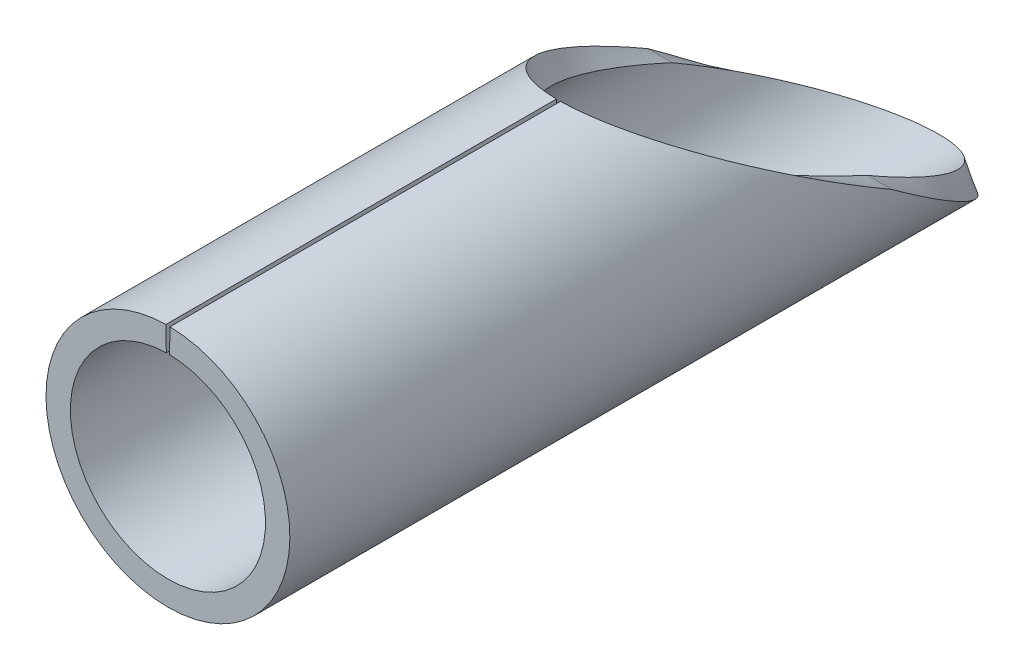
ISO-10303-21;
HEADER;
FILE_DESCRIPTION(('STEP AP214'),'2;1');
FILE_NAME('part.step','',(''),(''),'','','');
FILE_SCHEMA(('AUTOMOTIVE_DESIGN { 1 0 10303 214 1 1 1 1 }'));
ENDSEC;
DATA;
#1=APPLICATION_CONTEXT('core data for automotive mechanical design processes');
#2=APPLICATION_PROTOCOL_DEFINITION('international standard','automotive_design',2000,#1);
#3=PRODUCT_CONTEXT('',#1,'mechanical');
#4=PRODUCT('Part','Part','',(#3));
#5=PRODUCT_RELATED_PRODUCT_CATEGORY('part','',(#4));
#6=PRODUCT_DEFINITION_FORMATION('','',#4);
#7=PRODUCT_DEFINITION_CONTEXT('part definition',#1,'design');
#8=PRODUCT_DEFINITION('design','',#6,#7);
#9=PRODUCT_DEFINITION_SHAPE('','',#8);
#10=(LENGTH_UNIT() NAMED_UNIT(*) SI_UNIT(.MILLI.,.METRE.));
#11=(NAMED_UNIT(*) PLANE_ANGLE_UNIT() SI_UNIT($,.RADIAN.));
#12=(NAMED_UNIT(*) SI_UNIT($,.STERADIAN.) SOLID_ANGLE_UNIT());
#13=UNCERTAINTY_MEASURE_WITH_UNIT(LENGTH_MEASURE(1.E-05),#10,'distance_accuracy_value','');
#14=(GEOMETRIC_REPRESENTATION_CONTEXT(3) GLOBAL_UNCERTAINTY_ASSIGNED_CONTEXT((#13)) GLOBAL_UNIT_ASSIGNED_CONTEXT((#10,
#11,#12)) REPRESENTATION_CONTEXT('',''));
#15=CARTESIAN_POINT('',(0.,0.,0.));
#16=DIRECTION('',(0.,0.,1.));
#17=DIRECTION('',(1.,0.,0.));
#18=AXIS2_PLACEMENT_3D('',#15,#16,#17);
#19=CARTESIAN_POINT('',(0.,0.,100.));
#20=DIRECTION('',(0.,0.,-1.));
#21=DIRECTION('',(-1.,0.,0.));
#22=AXIS2_PLACEMENT_3D('',#19,#20,#21);
#23=CYLINDRICAL_SURFACE('',#22,15.);
#24=CARTESIAN_POINT('',(0.,0.,25.9807621135329));
#25=DIRECTION('',(0.,-0.866025403784436,0.500000000000004));
#26=DIRECTION('',(0.,-0.500000000000004,-0.866025403784436));
#27=AXIS2_PLACEMENT_3D('',#24,#25,#26);
#28=ELLIPSE('',#27,29.9999999999998,15.);
#29=CARTESIAN_POINT('',(-0.250000000000001,14.9979165219706,51.9579155372625));
#30=VERTEX_POINT('',#29);
#31=CARTESIAN_POINT('',(-15.,0.,25.9807621135329));
#32=VERTEX_POINT('',#31);
#33=EDGE_CURVE('E55',#30,#32,#28,.T.);
#34=ORIENTED_EDGE('',*,*,#33,.T.);
#35=CARTESIAN_POINT('',(0.,0.,25.9807621135329));
#36=DIRECTION('',(0.,-0.81088485407938,0.585205735980657));
#37=DIRECTION('',(0.,-0.585205735980657,-0.81088485407938));
#38=AXIS2_PLACEMENT_3D('',#35,#36,#37);
#39=ELLIPSE('',#38,25.6320112359524,15.);
#40=CARTESIAN_POINT('',(15.,0.,25.9807621135328));
#41=VERTEX_POINT('',#40);
#42=EDGE_CURVE('E109',#32,#41,#39,.T.);
#43=ORIENTED_EDGE('',*,*,#42,.T.);
#44=CARTESIAN_POINT('',(0.,0.,25.9807621135329));
#45=DIRECTION('',(0.,-0.866025403784436,0.500000000000004));
#46=DIRECTION('',(0.,-0.500000000000004,-0.866025403784436));
#47=AXIS2_PLACEMENT_3D('',#44,#45,#46);
#48=ELLIPSE('',#47,29.9999999999998,15.);
#49=CARTESIAN_POINT('',(0.250000000000002,14.9979165219706,51.9579155372625));
#50=VERTEX_POINT('',#49);
#51=EDGE_CURVE('E93',#41,#50,#48,.T.);
#52=ORIENTED_EDGE('',*,*,#51,.T.);
#53=DIRECTION('',(0.,0.,-1.));
#54=VECTOR('',#53,1.);
#55=CARTESIAN_POINT('',(0.250000000000002,14.9979165219706,100.));
#56=LINE('',#55,#54);
#57=CARTESIAN_POINT('',(0.250000000000002,14.9979165219706,100.));
#58=VERTEX_POINT('',#57);
#59=EDGE_CURVE('E11',#58,#50,#56,.T.);
#60=ORIENTED_EDGE('',*,*,#59,.F.);
#61=CARTESIAN_POINT('',(0.,0.,100.));
#62=DIRECTION('',(0.,0.,1.));
#63=DIRECTION('',(1.,0.,0.));
#64=AXIS2_PLACEMENT_3D('',#61,#62,#63);
#65=CIRCLE('',#64,15.);
#66=CARTESIAN_POINT('',(-0.250000000000001,14.9979165219706,100.));
#67=VERTEX_POINT('',#66);
#68=EDGE_CURVE('E126',#67,#58,#65,.T.);
#69=ORIENTED_EDGE('',*,*,#68,.F.);
#70=DIRECTION('',(0.,0.,-1.));
#71=VECTOR('',#70,1.);
#72=CARTESIAN_POINT('',(-0.250000000000001,14.9979165219706,100.));
#73=LINE('',#72,#71);
#74=EDGE_CURVE('E62',#67,#30,#73,.T.);
#75=ORIENTED_EDGE('',*,*,#74,.T.);
#76=EDGE_LOOP('',(#34,#43,#52,#60,#69,#75));
#77=FACE_BOUND('',#76,.T.);
#78=ADVANCED_FACE('F41',(#77),#23,.T.);
#79=CARTESIAN_POINT('',(0.200000000000002,11.9983332175765,100.));
#80=DIRECTION('',(-0.99986110146471,0.0166666666666668,0.));
#81=DIRECTION('',(-0.0166666666666668,-0.99986110146471,0.));
#82=AXIS2_PLACEMENT_3D('',#79,#80,#81);
#83=PLANE('',#82);
#84=ORIENTED_EDGE('',*,*,#59,.T.);
#85=DIRECTION('',(0.0166666666666668,0.99986110146471,0.));
#86=VECTOR('',#85,1.);
#87=CARTESIAN_POINT('',(0.250000000000002,14.9979165219706,51.9579155372625));
#88=LINE('',#87,#86);
#89=CARTESIAN_POINT('',(0.200000000000001,11.9983332175765,51.9579155372625));
#90=VERTEX_POINT('',#89);
#91=EDGE_CURVE('E99',#50,#90,#88,.F.);
#92=ORIENTED_EDGE('',*,*,#91,.T.);
#93=DIRECTION('',(0.,0.,-1.));
#94=VECTOR('',#93,1.);
#95=CARTESIAN_POINT('',(0.200000000000002,11.9983332175765,100.));
#96=LINE('',#95,#94);
#97=CARTESIAN_POINT('',(0.200000000000002,11.9983332175765,100.));
#98=VERTEX_POINT('',#97);
#99=EDGE_CURVE('E48',#98,#90,#96,.T.);
#100=ORIENTED_EDGE('',*,*,#99,.F.);
#101=DIRECTION('',(0.0166666666666668,0.99986110146471,0.));
#102=VECTOR('',#101,1.);
#103=CARTESIAN_POINT('',(0.200000000000002,11.9983332175765,100.));
#104=LINE('',#103,#102);
#105=EDGE_CURVE('E129',#98,#58,#104,.T.);
#106=ORIENTED_EDGE('',*,*,#105,.T.);
#107=EDGE_LOOP('',(#84,#92,#100,#106));
#108=FACE_BOUND('',#107,.T.);
#109=ADVANCED_FACE('F146',(#108),#83,.T.);
#110=CARTESIAN_POINT('',(0.,0.,100.));
#111=DIRECTION('',(0.,0.,-1.));
#112=DIRECTION('',(-1.,0.,0.));
#113=AXIS2_PLACEMENT_3D('',#110,#111,#112);
#114=CYLINDRICAL_SURFACE('',#113,12.);
#115=CARTESIAN_POINT('',(0.,0.,25.9807621135329));
#116=DIRECTION('',(0.,-0.866025403784436,0.500000000000004));
#117=DIRECTION('',(0.,-0.500000000000004,-0.866025403784436));
#118=AXIS2_PLACEMENT_3D('',#115,#116,#117);
#119=ELLIPSE('',#118,23.9999999999998,12.);
#120=CARTESIAN_POINT('',(-12.,0.,25.9807621135329));
#121=VERTEX_POINT('',#120);
#122=CARTESIAN_POINT('',(12.,0.,25.9807621135329));
#123=VERTEX_POINT('',#122);
#124=EDGE_CURVE('E111',#121,#123,#119,.T.);
#125=ORIENTED_EDGE('',*,*,#124,.F.);
#126=CARTESIAN_POINT('',(0.,0.,25.9807621135329));
#127=DIRECTION('',(0.,-0.907841299003202,0.419313934688771));
#128=DIRECTION('',(0.,-0.419313934688771,-0.907841299003202));
#129=AXIS2_PLACEMENT_3D('',#126,#127,#128);
#130=ELLIPSE('',#129,28.6181760425081,12.);
#131=CARTESIAN_POINT('',(-0.199999999999999,11.9983332175765,51.9579155372625));
#132=VERTEX_POINT('',#131);
#133=EDGE_CURVE('E116',#132,#121,#130,.T.);
#134=ORIENTED_EDGE('',*,*,#133,.F.);
#135=DIRECTION('',(0.,0.,-1.));
#136=VECTOR('',#135,1.);
#137=CARTESIAN_POINT('',(-0.200000000000001,11.9983332175765,100.));
#138=LINE('',#137,#136);
#139=CARTESIAN_POINT('',(-0.200000000000001,11.9983332175765,100.));
#140=VERTEX_POINT('',#139);
#141=EDGE_CURVE('E138',#140,#132,#138,.T.);
#142=ORIENTED_EDGE('',*,*,#141,.F.);
#143=CARTESIAN_POINT('',(0.,0.,100.));
#144=DIRECTION('',(0.,0.,1.));
#145=DIRECTION('',(1.,0.,0.));
#146=AXIS2_PLACEMENT_3D('',#143,#144,#145);
#147=CIRCLE('',#146,12.);
#148=EDGE_CURVE('E132',#140,#98,#147,.T.);
#149=ORIENTED_EDGE('',*,*,#148,.T.);
#150=ORIENTED_EDGE('',*,*,#99,.T.);
#151=CARTESIAN_POINT('',(0.,0.,25.9807621135329));
#152=DIRECTION('',(0.,-0.907841299003202,0.419313934688771));
#153=DIRECTION('',(0.,-0.419313934688771,-0.907841299003202));
#154=AXIS2_PLACEMENT_3D('',#151,#152,#153);
#155=ELLIPSE('',#154,28.6181760425081,12.);
#156=EDGE_CURVE('E103',#123,#90,#155,.T.);
#157=ORIENTED_EDGE('',*,*,#156,.F.);
#158=EDGE_LOOP('',(#125,#134,#142,#149,#150,#157));
#159=FACE_BOUND('',#158,.T.);
#160=ADVANCED_FACE('F142',(#159),#114,.F.);
#161=CARTESIAN_POINT('',(-0.250000000000001,14.9979165219706,100.));
#162=DIRECTION('',(0.99986110146471,0.0166666666666667,0.));
#163=DIRECTION('',(-0.0166666666666667,0.99986110146471,0.));
#164=AXIS2_PLACEMENT_3D('',#161,#162,#163);
#165=PLANE('',#164);
#166=ORIENTED_EDGE('',*,*,#141,.T.);
#167=DIRECTION('',(-0.0166666666666667,0.99986110146471,0.));
#168=VECTOR('',#167,1.);
#169=CARTESIAN_POINT('',(-0.250000000000001,14.9979165219706,51.9579155372625));
#170=LINE('',#169,#168);
#171=EDGE_CURVE('E122',#30,#132,#170,.F.);
#172=ORIENTED_EDGE('',*,*,#171,.F.);
#173=ORIENTED_EDGE('',*,*,#74,.F.);
#174=DIRECTION('',(0.0166666666666667,-0.99986110146471,0.));
#175=VECTOR('',#174,1.);
#176=CARTESIAN_POINT('',(-0.250000000000001,14.9979165219706,100.));
#177=LINE('',#176,#175);
#178=EDGE_CURVE('E135',#67,#140,#177,.T.);
#179=ORIENTED_EDGE('',*,*,#178,.T.);
#180=EDGE_LOOP('',(#166,#172,#173,#179));
#181=FACE_BOUND('',#180,.T.);
#182=ADVANCED_FACE('F150',(#181),#165,.T.);
#183=CARTESIAN_POINT('',(0.,0.,100.));
#184=DIRECTION('',(0.,0.,1.));
#185=DIRECTION('',(1.,0.,0.));
#186=AXIS2_PLACEMENT_3D('',#183,#184,#185);
#187=PLANE('',#186);
#188=ORIENTED_EDGE('',*,*,#68,.T.);
#189=ORIENTED_EDGE('',*,*,#105,.F.);
#190=ORIENTED_EDGE('',*,*,#148,.F.);
#191=ORIENTED_EDGE('',*,*,#178,.F.);
#192=EDGE_LOOP('',(#188,#189,#190,#191));
#193=FACE_BOUND('',#192,.T.);
#194=ADVANCED_FACE('F148',(#193),#187,.T.);
#195=CARTESIAN_POINT('',(0.,-12.,0.));
#196=CARTESIAN_POINT('',(0.,-13.,0.));
#197=CARTESIAN_POINT('',(0.,-14.,0.));
#198=CARTESIAN_POINT('',(0.,-15.,0.));
#199=CARTESIAN_POINT('',(24.,-12.,0.));
#200=CARTESIAN_POINT('',(26.,-13.,0.));
#201=CARTESIAN_POINT('',(28.,-14.,0.));
#202=CARTESIAN_POINT('',(30.,-15.,0.));
#203=CARTESIAN_POINT('',(24.,12.,51.9615242270658));
#204=CARTESIAN_POINT('',(26.,13.,51.9615242270658));
#205=CARTESIAN_POINT('',(28.,14.,51.9615242270658));
#206=CARTESIAN_POINT('',(30.,15.,51.9615242270658));
#207=CARTESIAN_POINT('',(0.,12.,51.9615242270658));
#208=CARTESIAN_POINT('',(0.,13.,51.9615242270658));
#209=CARTESIAN_POINT('',(0.,14.,51.9615242270658));
#210=CARTESIAN_POINT('',(0.,15.,51.9615242270658));
#211=CARTESIAN_POINT('',(-24.,12.,51.9615242270658));
#212=CARTESIAN_POINT('',(-26.,13.,51.9615242270658));
#213=CARTESIAN_POINT('',(-28.,14.,51.9615242270658));
#214=CARTESIAN_POINT('',(-30.,15.,51.9615242270658));
#215=CARTESIAN_POINT('',(-24.,-12.,0.));
#216=CARTESIAN_POINT('',(-26.,-13.,0.));
#217=CARTESIAN_POINT('',(-28.,-14.,0.));
#218=CARTESIAN_POINT('',(-30.,-15.,0.));
#219=CARTESIAN_POINT('',(0.,-12.,0.));
#220=CARTESIAN_POINT('',(0.,-13.,0.));
#221=CARTESIAN_POINT('',(0.,-14.,0.));
#222=CARTESIAN_POINT('',(0.,-15.,0.));
#223=(BOUNDED_SURFACE() B_SPLINE_SURFACE(3,3,((#195,#196,#197,#198),(#199,#200,#201,#202),(#203,
#204,#205,#206),(#207,#208,#209,#210),(#211,#212,#213,#214),(#215,#216,#217,#218),(#219,#220,
#221,#222)),.UNSPECIFIED.,.T.,.F.,.F.) B_SPLINE_SURFACE_WITH_KNOTS((4,3,4),(4,4),(0.,0.5,1.),
(0.,1.),.UNSPECIFIED.) GEOMETRIC_REPRESENTATION_ITEM() RATIONAL_B_SPLINE_SURFACE(((1.,1.,1.,1.),
(0.333333333333333,0.333333333333333,0.333333333333333,0.333333333333333),(0.333333333333333,
0.333333333333333,0.333333333333333,0.333333333333333),(1.,1.,1.,1.),(0.333333333333333,
0.333333333333333,0.333333333333333,0.333333333333333),(0.333333333333333,0.333333333333333,
0.333333333333333,0.333333333333333),(1.,1.,1.,1.))) REPRESENTATION_ITEM('') SURFACE());
#224=DIRECTION('',(-1.,0.,0.));
#225=VECTOR('',#224,1.);
#226=CARTESIAN_POINT('',(-15.,0.,25.9807621135329));
#227=LINE('',#226,#225);
#228=EDGE_CURVE('E124',#32,#121,#227,.F.);
#229=ORIENTED_EDGE('',*,*,#228,.F.);
#230=ORIENTED_EDGE('',*,*,#33,.F.);
#231=ORIENTED_EDGE('',*,*,#171,.T.);
#232=ORIENTED_EDGE('',*,*,#133,.T.);
#233=EDGE_LOOP('',(#229,#230,#231,#232));
#234=FACE_BOUND('',#233,.T.);
#235=ADVANCED_FACE('F152',(#234),#223,.T.);
#236=CARTESIAN_POINT('',(0.,-12.,5.19615242270656));
#237=CARTESIAN_POINT('',(0.,-13.,5.19615242270656));
#238=CARTESIAN_POINT('',(0.,-14.,5.19615242270656));
#239=CARTESIAN_POINT('',(0.,-15.,5.19615242270656));
#240=CARTESIAN_POINT('',(24.,-12.,5.19615242270656));
#241=CARTESIAN_POINT('',(26.,-13.,5.19615242270656));
#242=CARTESIAN_POINT('',(28.,-14.,5.19615242270656));
#243=CARTESIAN_POINT('',(30.,-15.,5.19615242270656));
#244=CARTESIAN_POINT('',(24.,12.,46.7653718043592));
#245=CARTESIAN_POINT('',(26.,13.,46.7653718043592));
#246=CARTESIAN_POINT('',(28.,14.,46.7653718043592));
#247=CARTESIAN_POINT('',(30.,15.,46.7653718043592));
#248=CARTESIAN_POINT('',(0.,12.,46.7653718043592));
#249=CARTESIAN_POINT('',(0.,13.,46.7653718043592));
#250=CARTESIAN_POINT('',(0.,14.,46.7653718043592));
#251=CARTESIAN_POINT('',(0.,15.,46.7653718043592));
#252=CARTESIAN_POINT('',(-24.,12.,46.7653718043592));
#253=CARTESIAN_POINT('',(-26.,13.,46.7653718043592));
#254=CARTESIAN_POINT('',(-28.,14.,46.7653718043592));
#255=CARTESIAN_POINT('',(-30.,15.,46.7653718043592));
#256=CARTESIAN_POINT('',(-24.,-12.,5.19615242270656));
#257=CARTESIAN_POINT('',(-26.,-13.,5.19615242270656));
#258=CARTESIAN_POINT('',(-28.,-14.,5.19615242270656));
#259=CARTESIAN_POINT('',(-30.,-15.,5.19615242270656));
#260=CARTESIAN_POINT('',(0.,-12.,5.19615242270656));
#261=CARTESIAN_POINT('',(0.,-13.,5.19615242270656));
#262=CARTESIAN_POINT('',(0.,-14.,5.19615242270656));
#263=CARTESIAN_POINT('',(0.,-15.,5.19615242270656));
#264=(BOUNDED_SURFACE() B_SPLINE_SURFACE(3,3,((#236,#237,#238,#239),(#240,#241,#242,#243),(#244,
#245,#246,#247),(#248,#249,#250,#251),(#252,#253,#254,#255),(#256,#257,#258,#259),(#260,#261,
#262,#263)),.UNSPECIFIED.,.T.,.F.,.F.) B_SPLINE_SURFACE_WITH_KNOTS((4,3,4),(4,4),(0.,0.5,1.),
(0.,1.),.UNSPECIFIED.) GEOMETRIC_REPRESENTATION_ITEM() RATIONAL_B_SPLINE_SURFACE(((1.,1.,1.,1.),
(0.333333333333333,0.333333333333333,0.333333333333333,0.333333333333333),(0.333333333333333,
0.333333333333333,0.333333333333333,0.333333333333333),(1.,1.,1.,1.),(0.333333333333333,
0.333333333333333,0.333333333333333,0.333333333333333),(0.333333333333333,0.333333333333333,
0.333333333333333,0.333333333333333),(1.,1.,1.,1.))) REPRESENTATION_ITEM('') SURFACE());
#265=DIRECTION('',(1.,0.,0.));
#266=VECTOR('',#265,1.);
#267=CARTESIAN_POINT('',(15.,0.,25.9807621135329));
#268=LINE('',#267,#266);
#269=EDGE_CURVE('E96',#41,#123,#268,.F.);
#270=ORIENTED_EDGE('',*,*,#42,.F.);
#271=ORIENTED_EDGE('',*,*,#228,.T.);
#272=ORIENTED_EDGE('',*,*,#124,.T.);
#273=ORIENTED_EDGE('',*,*,#269,.F.);
#274=EDGE_LOOP('',(#270,#271,#272,#273));
#275=FACE_BOUND('',#274,.T.);
#276=ADVANCED_FACE('F107',(#275),#264,.T.);
#277=CARTESIAN_POINT('',(0.,-12.,0.));
#278=CARTESIAN_POINT('',(0.,-13.,0.));
#279=CARTESIAN_POINT('',(0.,-14.,0.));
#280=CARTESIAN_POINT('',(0.,-15.,0.));
#281=CARTESIAN_POINT('',(24.,-12.,0.));
#282=CARTESIAN_POINT('',(26.,-13.,0.));
#283=CARTESIAN_POINT('',(28.,-14.,0.));
#284=CARTESIAN_POINT('',(30.,-15.,0.));
#285=CARTESIAN_POINT('',(24.,12.,51.9615242270658));
#286=CARTESIAN_POINT('',(26.,13.,51.9615242270658));
#287=CARTESIAN_POINT('',(28.,14.,51.9615242270658));
#288=CARTESIAN_POINT('',(30.,15.,51.9615242270658));
#289=CARTESIAN_POINT('',(0.,12.,51.9615242270658));
#290=CARTESIAN_POINT('',(0.,13.,51.9615242270658));
#291=CARTESIAN_POINT('',(0.,14.,51.9615242270658));
#292=CARTESIAN_POINT('',(0.,15.,51.9615242270658));
#293=CARTESIAN_POINT('',(-24.,12.,51.9615242270658));
#294=CARTESIAN_POINT('',(-26.,13.,51.9615242270658));
#295=CARTESIAN_POINT('',(-28.,14.,51.9615242270658));
#296=CARTESIAN_POINT('',(-30.,15.,51.9615242270658));
#297=CARTESIAN_POINT('',(-24.,-12.,0.));
#298=CARTESIAN_POINT('',(-26.,-13.,0.));
#299=CARTESIAN_POINT('',(-28.,-14.,0.));
#300=CARTESIAN_POINT('',(-30.,-15.,0.));
#301=CARTESIAN_POINT('',(0.,-12.,0.));
#302=CARTESIAN_POINT('',(0.,-13.,0.));
#303=CARTESIAN_POINT('',(0.,-14.,0.));
#304=CARTESIAN_POINT('',(0.,-15.,0.));
#305=(BOUNDED_SURFACE() B_SPLINE_SURFACE(3,3,((#277,#278,#279,#280),(#281,#282,#283,#284),(#285,
#286,#287,#288),(#289,#290,#291,#292),(#293,#294,#295,#296),(#297,#298,#299,#300),(#301,#302,
#303,#304)),.UNSPECIFIED.,.T.,.F.,.F.) B_SPLINE_SURFACE_WITH_KNOTS((4,3,4),(4,4),(0.,0.5,1.),
(0.,1.),.UNSPECIFIED.) GEOMETRIC_REPRESENTATION_ITEM() RATIONAL_B_SPLINE_SURFACE(((1.,1.,1.,1.),
(0.333333333333333,0.333333333333333,0.333333333333333,0.333333333333333),(0.333333333333333,
0.333333333333333,0.333333333333333,0.333333333333333),(1.,1.,1.,1.),(0.333333333333333,
0.333333333333333,0.333333333333333,0.333333333333333),(0.333333333333333,0.333333333333333,
0.333333333333333,0.333333333333333),(1.,1.,1.,1.))) REPRESENTATION_ITEM('') SURFACE());
#306=ORIENTED_EDGE('',*,*,#91,.F.);
#307=ORIENTED_EDGE('',*,*,#51,.F.);
#308=ORIENTED_EDGE('',*,*,#269,.T.);
#309=ORIENTED_EDGE('',*,*,#156,.T.);
#310=EDGE_LOOP('',(#306,#307,#308,#309));
#311=FACE_BOUND('',#310,.T.);
#312=ADVANCED_FACE('F95',(#311),#305,.T.);
#313=CLOSED_SHELL('',(#78,#109,#160,#182,#194,#235,#276,#312));
#314=MANIFOLD_SOLID_BREP('B2',#313);
#315=ADVANCED_BREP_SHAPE_REPRESENTATION('',(#18,#314),#14);
#316=SHAPE_DEFINITION_REPRESENTATION(#9,#315);
ENDSEC;
END-ISO-10303-21;
